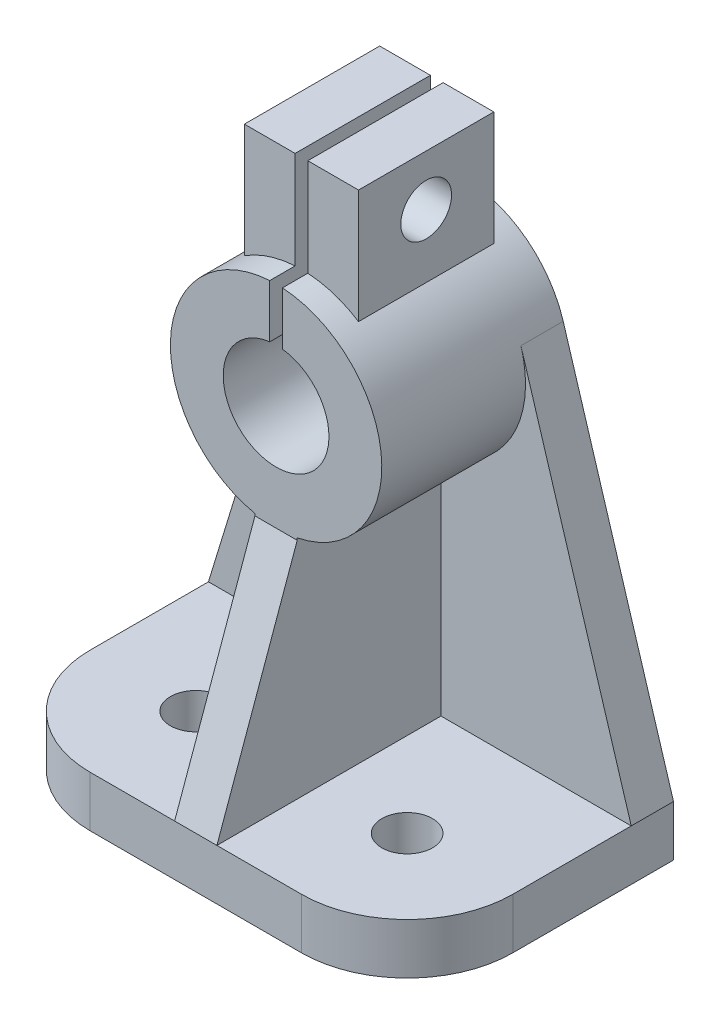
ISO-10303-21;
HEADER;
FILE_DESCRIPTION(('STEP AP214'),'2;1');
FILE_NAME('part.step','',(''),(''),'','','');
FILE_SCHEMA(('AUTOMOTIVE_DESIGN { 1 0 10303 214 1 1 1 1 }'));
ENDSEC;
DATA;
#1=APPLICATION_CONTEXT('core data for automotive mechanical design processes');
#2=APPLICATION_PROTOCOL_DEFINITION('international standard','automotive_design',2000,#1);
#3=PRODUCT_CONTEXT('',#1,'mechanical');
#4=PRODUCT('Part','Part','',(#3));
#5=PRODUCT_RELATED_PRODUCT_CATEGORY('part','',(#4));
#6=PRODUCT_DEFINITION_FORMATION('','',#4);
#7=PRODUCT_DEFINITION_CONTEXT('part definition',#1,'design');
#8=PRODUCT_DEFINITION('design','',#6,#7);
#9=PRODUCT_DEFINITION_SHAPE('','',#8);
#10=(LENGTH_UNIT() NAMED_UNIT(*) SI_UNIT(.MILLI.,.METRE.));
#11=(NAMED_UNIT(*) PLANE_ANGLE_UNIT() SI_UNIT($,.RADIAN.));
#12=(NAMED_UNIT(*) SI_UNIT($,.STERADIAN.) SOLID_ANGLE_UNIT());
#13=UNCERTAINTY_MEASURE_WITH_UNIT(LENGTH_MEASURE(1.E-05),#10,'distance_accuracy_value','');
#14=(GEOMETRIC_REPRESENTATION_CONTEXT(3) GLOBAL_UNCERTAINTY_ASSIGNED_CONTEXT((#13)) GLOBAL_UNIT_ASSIGNED_CONTEXT((#10,
#11,#12)) REPRESENTATION_CONTEXT('',''));
#15=CARTESIAN_POINT('',(0.,0.,0.));
#16=DIRECTION('',(0.,0.,1.));
#17=DIRECTION('',(1.,0.,0.));
#18=AXIS2_PLACEMENT_3D('',#15,#16,#17);
#19=CARTESIAN_POINT('',(0.,0.,-21.5));
#20=DIRECTION('',(0.,0.,-1.));
#21=DIRECTION('',(-1.,0.,0.));
#22=AXIS2_PLACEMENT_3D('',#19,#20,#21);
#23=PLANE('',#22);
#24=CARTESIAN_POINT('',(0.,90.,-21.5));
#25=DIRECTION('',(0.,0.,-1.));
#26=DIRECTION('',(-1.,0.,0.));
#27=AXIS2_PLACEMENT_3D('',#24,#25,#26);
#28=CIRCLE('',#27,25.);
#29=CARTESIAN_POINT('',(23.9067793629531,97.312038053175,-21.5));
#30=VERTEX_POINT('',#29);
#31=CARTESIAN_POINT('',(5.,65.5051025721682,-21.5));
#32=VERTEX_POINT('',#31);
#33=EDGE_CURVE('E235',#30,#32,#28,.T.);
#34=ORIENTED_EDGE('',*,*,#33,.T.);
#35=DIRECTION('',(0.,1.,0.));
#36=VECTOR('',#35,1.);
#37=CARTESIAN_POINT('',(5.,12.,-21.5));
#38=LINE('',#37,#36);
#39=CARTESIAN_POINT('',(5.,12.,-21.5));
#40=VERTEX_POINT('',#39);
#41=EDGE_CURVE('E218',#40,#32,#38,.T.);
#42=ORIENTED_EDGE('',*,*,#41,.F.);
#43=DIRECTION('',(1.,0.,0.));
#44=VECTOR('',#43,1.);
#45=CARTESIAN_POINT('',(0.,12.,-21.5));
#46=LINE('',#45,#44);
#47=CARTESIAN_POINT('',(50.,12.,-21.5));
#48=VERTEX_POINT('',#47);
#49=EDGE_CURVE('E362',#40,#48,#46,.T.);
#50=ORIENTED_EDGE('',*,*,#49,.T.);
#51=DIRECTION('',(-0.292481522127002,0.956271174518124,0.));
#52=VECTOR('',#51,1.);
#53=CARTESIAN_POINT('',(49.0790277449844,15.0111277238906,-21.5));
#54=LINE('',#53,#52);
#55=EDGE_CURVE('E244',#48,#30,#54,.T.);
#56=ORIENTED_EDGE('',*,*,#55,.T.);
#57=EDGE_LOOP('',(#34,#42,#50,#56));
#58=FACE_BOUND('',#57,.T.);
#59=ADVANCED_FACE('F44',(#58),#23,.F.);
#60=CARTESIAN_POINT('',(0.,90.,-21.5));
#61=DIRECTION('',(0.,0.,-1.));
#62=DIRECTION('',(-1.,0.,0.));
#63=AXIS2_PLACEMENT_3D('',#60,#61,#62);
#64=CYLINDRICAL_SURFACE('',#63,25.);
#65=CARTESIAN_POINT('',(0.,90.,12.5));
#66=DIRECTION('',(0.,0.,-1.));
#67=DIRECTION('',(-1.,0.,0.));
#68=AXIS2_PLACEMENT_3D('',#65,#66,#67);
#69=CIRCLE('',#68,25.);
#70=CARTESIAN_POINT('',(1.5,114.954959426936,12.5));
#71=VERTEX_POINT('',#70);
#72=CARTESIAN_POINT('',(5.,65.5051025721682,12.5));
#73=VERTEX_POINT('',#72);
#74=EDGE_CURVE('E239',#71,#73,#69,.T.);
#75=ORIENTED_EDGE('',*,*,#74,.T.);
#76=DIRECTION('',(0.,0.,-1.));
#77=VECTOR('',#76,1.);
#78=CARTESIAN_POINT('',(5.,65.5051025721682,-21.5));
#79=LINE('',#78,#77);
#80=EDGE_CURVE('E222',#32,#73,#79,.F.);
#81=ORIENTED_EDGE('',*,*,#80,.F.);
#82=ORIENTED_EDGE('',*,*,#33,.F.);
#83=DIRECTION('',(0.,0.,-1.));
#84=VECTOR('',#83,1.);
#85=CARTESIAN_POINT('',(23.9067793629531,97.312038053175,-21.5));
#86=LINE('',#85,#84);
#87=CARTESIAN_POINT('',(23.9067793629531,97.312038053175,-31.5));
#88=VERTEX_POINT('',#87);
#89=EDGE_CURVE('E339',#30,#88,#86,.T.);
#90=ORIENTED_EDGE('',*,*,#89,.T.);
#91=CARTESIAN_POINT('',(0.,90.,-31.5));
#92=DIRECTION('',(0.,0.,-1.));
#93=DIRECTION('',(-1.,0.,0.));
#94=AXIS2_PLACEMENT_3D('',#91,#92,#93);
#95=CIRCLE('',#94,25.);
#96=CARTESIAN_POINT('',(1.5,114.954959426936,-31.5));
#97=VERTEX_POINT('',#96);
#98=EDGE_CURVE('E355',#97,#88,#95,.T.);
#99=ORIENTED_EDGE('',*,*,#98,.F.);
#100=DIRECTION('',(0.,0.,-1.));
#101=VECTOR('',#100,1.);
#102=CARTESIAN_POINT('',(1.5,114.954959426936,-21.5));
#103=LINE('',#102,#101);
#104=CARTESIAN_POINT('',(1.5,114.954959426936,-25.5));
#105=VERTEX_POINT('',#104);
#106=EDGE_CURVE('E432',#105,#97,#103,.T.);
#107=ORIENTED_EDGE('',*,*,#106,.F.);
#108=CARTESIAN_POINT('',(0.,90.,-25.5));
#109=DIRECTION('',(0.,0.,-1.));
#110=DIRECTION('',(-1.,0.,0.));
#111=AXIS2_PLACEMENT_3D('',#108,#109,#110);
#112=CIRCLE('',#111,25.);
#113=CARTESIAN_POINT('',(13.5,111.041625412501,-25.5));
#114=VERTEX_POINT('',#113);
#115=EDGE_CURVE('E392',#105,#114,#112,.T.);
#116=ORIENTED_EDGE('',*,*,#115,.T.);
#117=DIRECTION('',(0.,0.,-1.));
#118=VECTOR('',#117,1.);
#119=CARTESIAN_POINT('',(13.5,111.041625412501,-21.5));
#120=LINE('',#119,#118);
#121=CARTESIAN_POINT('',(13.5,111.041625412501,6.49999999999999));
#122=VERTEX_POINT('',#121);
#123=EDGE_CURVE('E380',#114,#122,#120,.F.);
#124=ORIENTED_EDGE('',*,*,#123,.T.);
#125=CARTESIAN_POINT('',(0.,90.,6.49999999999999));
#126=DIRECTION('',(0.,0.,1.));
#127=DIRECTION('',(1.,0.,0.));
#128=AXIS2_PLACEMENT_3D('',#125,#126,#127);
#129=CIRCLE('',#128,25.);
#130=CARTESIAN_POINT('',(1.5,114.954959426936,6.49999999999999));
#131=VERTEX_POINT('',#130);
#132=EDGE_CURVE('E385',#122,#131,#129,.T.);
#133=ORIENTED_EDGE('',*,*,#132,.T.);
#134=EDGE_CURVE('E431',#71,#131,#103,.T.);
#135=ORIENTED_EDGE('',*,*,#134,.F.);
#136=EDGE_LOOP('',(#75,#81,#82,#90,#99,#107,#116,#124,#133,#135));
#137=FACE_BOUND('',#136,.T.);
#138=ADVANCED_FACE('F233',(#137),#64,.T.);
#139=CARTESIAN_POINT('',(-50.,12.,-21.5));
#140=VERTEX_POINT('',#139);
#141=CARTESIAN_POINT('',(-5.,12.,-21.5));
#142=VERTEX_POINT('',#141);
#143=EDGE_CURVE('E340',#140,#142,#46,.T.);
#144=ORIENTED_EDGE('',*,*,#143,.T.);
#145=DIRECTION('',(0.,-1.,0.));
#146=VECTOR('',#145,1.);
#147=CARTESIAN_POINT('',(-5.,138.001,-21.5));
#148=LINE('',#147,#146);
#149=CARTESIAN_POINT('',(-5.,65.5051025721682,-21.5));
#150=VERTEX_POINT('',#149);
#151=EDGE_CURVE('E61',#150,#142,#148,.T.);
#152=ORIENTED_EDGE('',*,*,#151,.F.);
#153=CARTESIAN_POINT('',(-23.9067793629531,97.3120380531751,-21.5));
#154=VERTEX_POINT('',#153);
#155=EDGE_CURVE('E247',#150,#154,#28,.T.);
#156=ORIENTED_EDGE('',*,*,#155,.T.);
#157=DIRECTION('',(0.292481522127003,0.956271174518124,0.));
#158=VECTOR('',#157,1.);
#159=CARTESIAN_POINT('',(-49.0790277449844,15.0111277238906,-21.5));
#160=LINE('',#159,#158);
#161=EDGE_CURVE('E350',#140,#154,#160,.T.);
#162=ORIENTED_EDGE('',*,*,#161,.F.);
#163=EDGE_LOOP('',(#144,#152,#156,#162));
#164=FACE_BOUND('',#163,.T.);
#165=ADVANCED_FACE('F633',(#164),#23,.F.);
#166=CARTESIAN_POINT('',(0.,12.,0.));
#167=DIRECTION('',(0.,1.,0.));
#168=DIRECTION('',(0.,0.,1.));
#169=AXIS2_PLACEMENT_3D('',#166,#167,#168);
#170=PLANE('',#169);
#171=CARTESIAN_POINT('',(-25.,12.,6.49999999999999));
#172=DIRECTION('',(0.,1.,0.));
#173=DIRECTION('',(0.,0.,1.));
#174=AXIS2_PLACEMENT_3D('',#171,#172,#173);
#175=CIRCLE('',#174,6.);
#176=CARTESIAN_POINT('',(-25.,12.,12.5));
#177=VERTEX_POINT('',#176);
#178=EDGE_CURVE('E329',#177,#177,#175,.T.);
#179=ORIENTED_EDGE('',*,*,#178,.F.);
#180=EDGE_LOOP('',(#179));
#181=FACE_BOUND('',#180,.T.);
#182=DIRECTION('',(1.,0.,0.));
#183=VECTOR('',#182,1.);
#184=CARTESIAN_POINT('',(-50.,12.,31.5));
#185=LINE('',#184,#183);
#186=CARTESIAN_POINT('',(-25.,12.,31.5));
#187=VERTEX_POINT('',#186);
#188=CARTESIAN_POINT('',(-5.,12.,31.5));
#189=VERTEX_POINT('',#188);
#190=EDGE_CURVE('E291',#187,#189,#185,.T.);
#191=ORIENTED_EDGE('',*,*,#190,.T.);
#192=DIRECTION('',(0.,0.,-1.));
#193=VECTOR('',#192,1.);
#194=CARTESIAN_POINT('',(-5.,12.,31.5));
#195=LINE('',#194,#193);
#196=EDGE_CURVE('E497',#189,#142,#195,.T.);
#197=ORIENTED_EDGE('',*,*,#196,.T.);
#198=ORIENTED_EDGE('',*,*,#143,.F.);
#199=DIRECTION('',(0.,0.,1.));
#200=VECTOR('',#199,1.);
#201=CARTESIAN_POINT('',(-50.,12.,-31.5));
#202=LINE('',#201,#200);
#203=CARTESIAN_POINT('',(-50.,12.,6.5));
#204=VERTEX_POINT('',#203);
#205=EDGE_CURVE('E316',#140,#204,#202,.T.);
#206=ORIENTED_EDGE('',*,*,#205,.T.);
#207=CARTESIAN_POINT('',(-25.,12.,6.49999999999999));
#208=DIRECTION('',(0.,1.,0.));
#209=DIRECTION('',(0.,0.,1.));
#210=AXIS2_PLACEMENT_3D('',#207,#208,#209);
#211=CIRCLE('',#210,25.);
#212=EDGE_CURVE('E262',#204,#187,#211,.T.);
#213=ORIENTED_EDGE('',*,*,#212,.T.);
#214=EDGE_LOOP('',(#191,#197,#198,#206,#213));
#215=FACE_BOUND('',#214,.T.);
#216=ADVANCED_FACE('F642',(#181,#215),#170,.T.);
#217=ORIENTED_EDGE('',*,*,#155,.F.);
#218=DIRECTION('',(0.,0.,-1.));
#219=VECTOR('',#218,1.);
#220=CARTESIAN_POINT('',(-5.,65.5051025721682,-21.5));
#221=LINE('',#220,#219);
#222=CARTESIAN_POINT('',(-5.,65.5051025721682,12.5));
#223=VERTEX_POINT('',#222);
#224=EDGE_CURVE('E481',#223,#150,#221,.T.);
#225=ORIENTED_EDGE('',*,*,#224,.F.);
#226=CARTESIAN_POINT('',(-1.50000000000001,114.954959426936,12.5));
#227=VERTEX_POINT('',#226);
#228=EDGE_CURVE('E370',#223,#227,#69,.T.);
#229=ORIENTED_EDGE('',*,*,#228,.T.);
#230=DIRECTION('',(0.,0.,-1.));
#231=VECTOR('',#230,1.);
#232=CARTESIAN_POINT('',(-1.50000000000001,114.954959426936,-21.5));
#233=LINE('',#232,#231);
#234=CARTESIAN_POINT('',(-1.50000000000001,114.954959426936,6.49999999999999));
#235=VERTEX_POINT('',#234);
#236=EDGE_CURVE('E445',#235,#227,#233,.F.);
#237=ORIENTED_EDGE('',*,*,#236,.F.);
#238=CARTESIAN_POINT('',(-13.5,111.041625412501,6.49999999999999));
#239=VERTEX_POINT('',#238);
#240=EDGE_CURVE('E383',#235,#239,#129,.T.);
#241=ORIENTED_EDGE('',*,*,#240,.T.);
#242=DIRECTION('',(0.,0.,-1.));
#243=VECTOR('',#242,1.);
#244=CARTESIAN_POINT('',(-13.5,111.041625412501,-21.5));
#245=LINE('',#244,#243);
#246=CARTESIAN_POINT('',(-13.5,111.041625412501,-25.5));
#247=VERTEX_POINT('',#246);
#248=EDGE_CURVE('E389',#239,#247,#245,.T.);
#249=ORIENTED_EDGE('',*,*,#248,.T.);
#250=CARTESIAN_POINT('',(-1.50000000000001,114.954959426936,-25.5));
#251=VERTEX_POINT('',#250);
#252=EDGE_CURVE('E376',#247,#251,#112,.T.);
#253=ORIENTED_EDGE('',*,*,#252,.T.);
#254=CARTESIAN_POINT('',(-1.50000000000001,114.954959426936,-31.5));
#255=VERTEX_POINT('',#254);
#256=EDGE_CURVE('E444',#255,#251,#233,.F.);
#257=ORIENTED_EDGE('',*,*,#256,.F.);
#258=CARTESIAN_POINT('',(-23.9067793629531,97.3120380531751,-31.5));
#259=VERTEX_POINT('',#258);
#260=EDGE_CURVE('E351',#259,#255,#95,.T.);
#261=ORIENTED_EDGE('',*,*,#260,.F.);
#262=DIRECTION('',(0.,0.,-1.));
#263=VECTOR('',#262,1.);
#264=CARTESIAN_POINT('',(-23.9067793629531,97.3120380531751,-21.5));
#265=LINE('',#264,#263);
#266=EDGE_CURVE('E336',#154,#259,#265,.T.);
#267=ORIENTED_EDGE('',*,*,#266,.F.);
#268=EDGE_LOOP('',(#217,#225,#229,#237,#241,#249,#253,#257,#261,#267));
#269=FACE_BOUND('',#268,.T.);
#270=ADVANCED_FACE('F638',(#269),#64,.T.);
#271=CARTESIAN_POINT('',(-13.5,-0.001000000000001,6.49999999999999));
#272=DIRECTION('',(0.,0.,1.));
#273=DIRECTION('',(1.,0.,0.));
#274=AXIS2_PLACEMENT_3D('',#271,#272,#273);
#275=PLANE('',#274);
#276=DIRECTION('',(0.,1.,0.));
#277=VECTOR('',#276,1.);
#278=CARTESIAN_POINT('',(1.50000000000002,-0.000999999999998225,6.49999999999999));
#279=LINE('',#278,#277);
#280=CARTESIAN_POINT('',(1.49999999999999,138.,6.49999999999999));
#281=VERTEX_POINT('',#280);
#282=EDGE_CURVE('E69',#131,#281,#279,.T.);
#283=ORIENTED_EDGE('',*,*,#282,.F.);
#284=ORIENTED_EDGE('',*,*,#132,.F.);
#285=DIRECTION('',(0.,1.,0.));
#286=VECTOR('',#285,1.);
#287=CARTESIAN_POINT('',(13.5,-0.001000000000001,6.49999999999999));
#288=LINE('',#287,#286);
#289=CARTESIAN_POINT('',(13.5,138.,6.49999999999999));
#290=VERTEX_POINT('',#289);
#291=EDGE_CURVE('E407',#122,#290,#288,.T.);
#292=ORIENTED_EDGE('',*,*,#291,.T.);
#293=DIRECTION('',(1.,0.,0.));
#294=VECTOR('',#293,1.);
#295=CARTESIAN_POINT('',(-13.5,138.,6.49999999999999));
#296=LINE('',#295,#294);
#297=EDGE_CURVE('E424',#281,#290,#296,.T.);
#298=ORIENTED_EDGE('',*,*,#297,.F.);
#299=EDGE_LOOP('',(#283,#284,#292,#298));
#300=FACE_BOUND('',#299,.T.);
#301=ADVANCED_FACE('F695',(#300),#275,.T.);
#302=CARTESIAN_POINT('',(-13.5,-0.001000000000001,-25.5));
#303=DIRECTION('',(0.,0.,-1.));
#304=DIRECTION('',(-1.,0.,0.));
#305=AXIS2_PLACEMENT_3D('',#302,#303,#304);
#306=PLANE('',#305);
#307=DIRECTION('',(0.,-1.,0.));
#308=VECTOR('',#307,1.);
#309=CARTESIAN_POINT('',(1.50000000000002,-0.000999999999998225,-25.5));
#310=LINE('',#309,#308);
#311=CARTESIAN_POINT('',(1.49999999999999,138.,-25.5));
#312=VERTEX_POINT('',#311);
#313=EDGE_CURVE('E437',#312,#105,#310,.T.);
#314=ORIENTED_EDGE('',*,*,#313,.F.);
#315=DIRECTION('',(-1.,0.,0.));
#316=VECTOR('',#315,1.);
#317=CARTESIAN_POINT('',(-13.5,138.,-25.5));
#318=LINE('',#317,#316);
#319=CARTESIAN_POINT('',(13.5,138.,-25.5));
#320=VERTEX_POINT('',#319);
#321=EDGE_CURVE('E416',#320,#312,#318,.T.);
#322=ORIENTED_EDGE('',*,*,#321,.F.);
#323=DIRECTION('',(0.,1.,0.));
#324=VECTOR('',#323,1.);
#325=CARTESIAN_POINT('',(13.5,-0.001000000000001,-25.5));
#326=LINE('',#325,#324);
#327=EDGE_CURVE('E396',#114,#320,#326,.T.);
#328=ORIENTED_EDGE('',*,*,#327,.F.);
#329=ORIENTED_EDGE('',*,*,#115,.F.);
#330=EDGE_LOOP('',(#314,#322,#328,#329));
#331=FACE_BOUND('',#330,.T.);
#332=ADVANCED_FACE('F706',(#331),#306,.T.);
#333=CARTESIAN_POINT('',(0.,138.,0.));
#334=DIRECTION('',(0.,-1.,0.));
#335=DIRECTION('',(0.,0.,-1.));
#336=AXIS2_PLACEMENT_3D('',#333,#334,#335);
#337=PLANE('',#336);
#338=ORIENTED_EDGE('',*,*,#321,.T.);
#339=DIRECTION('',(0.,0.,1.));
#340=VECTOR('',#339,1.);
#341=CARTESIAN_POINT('',(1.49999999999999,138.,0.));
#342=LINE('',#341,#340);
#343=EDGE_CURVE('E11',#312,#281,#342,.T.);
#344=ORIENTED_EDGE('',*,*,#343,.T.);
#345=ORIENTED_EDGE('',*,*,#297,.T.);
#346=DIRECTION('',(0.,0.,-1.));
#347=VECTOR('',#346,1.);
#348=CARTESIAN_POINT('',(13.5,138.,6.49999999999999));
#349=LINE('',#348,#347);
#350=EDGE_CURVE('E399',#290,#320,#349,.T.);
#351=ORIENTED_EDGE('',*,*,#350,.T.);
#352=EDGE_LOOP('',(#338,#344,#345,#351));
#353=FACE_BOUND('',#352,.T.);
#354=ADVANCED_FACE('F703',(#353),#337,.F.);
#355=CARTESIAN_POINT('',(50.,12.,-31.5));
#356=DIRECTION('',(-1.,0.,0.));
#357=DIRECTION('',(0.,0.,1.));
#358=AXIS2_PLACEMENT_3D('',#355,#356,#357);
#359=PLANE('',#358);
#360=DIRECTION('',(0.,0.,-1.));
#361=VECTOR('',#360,1.);
#362=CARTESIAN_POINT('',(50.,12.,-31.5));
#363=LINE('',#362,#361);
#364=CARTESIAN_POINT('',(50.,12.,6.49999999999999));
#365=VERTEX_POINT('',#364);
#366=EDGE_CURVE('E296',#365,#48,#363,.T.);
#367=ORIENTED_EDGE('',*,*,#366,.F.);
#368=DIRECTION('',(0.,-1.,0.));
#369=VECTOR('',#368,1.);
#370=CARTESIAN_POINT('',(50.,12.,6.49999999999999));
#371=LINE('',#370,#369);
#372=CARTESIAN_POINT('',(50.,0.,6.49999999999999));
#373=VERTEX_POINT('',#372);
#374=EDGE_CURVE('E279',#365,#373,#371,.T.);
#375=ORIENTED_EDGE('',*,*,#374,.T.);
#376=DIRECTION('',(0.,0.,-1.));
#377=VECTOR('',#376,1.);
#378=CARTESIAN_POINT('',(50.,0.,-31.5));
#379=LINE('',#378,#377);
#380=CARTESIAN_POINT('',(50.,0.,-31.5));
#381=VERTEX_POINT('',#380);
#382=EDGE_CURVE('E304',#373,#381,#379,.T.);
#383=ORIENTED_EDGE('',*,*,#382,.T.);
#384=DIRECTION('',(0.,-1.,0.));
#385=VECTOR('',#384,1.);
#386=CARTESIAN_POINT('',(50.,12.,-31.5));
#387=LINE('',#386,#385);
#388=CARTESIAN_POINT('',(50.,12.,-31.5));
#389=VERTEX_POINT('',#388);
#390=EDGE_CURVE('E283',#389,#381,#387,.T.);
#391=ORIENTED_EDGE('',*,*,#390,.F.);
#392=DIRECTION('',(0.,0.,-1.));
#393=VECTOR('',#392,1.);
#394=CARTESIAN_POINT('',(50.,12.,-21.5));
#395=LINE('',#394,#393);
#396=EDGE_CURVE('E325',#48,#389,#395,.T.);
#397=ORIENTED_EDGE('',*,*,#396,.F.);
#398=EDGE_LOOP('',(#367,#375,#383,#391,#397));
#399=FACE_BOUND('',#398,.T.);
#400=ADVANCED_FACE('F677',(#399),#359,.F.);
#401=CARTESIAN_POINT('',(-50.,12.,-31.5));
#402=DIRECTION('',(0.,0.,1.));
#403=DIRECTION('',(1.,0.,0.));
#404=AXIS2_PLACEMENT_3D('',#401,#402,#403);
#405=PLANE('',#404);
#406=CARTESIAN_POINT('',(0.,90.,-31.5));
#407=DIRECTION('',(0.,0.,1.));
#408=DIRECTION('',(1.,0.,0.));
#409=AXIS2_PLACEMENT_3D('',#406,#407,#408);
#410=CIRCLE('',#409,12.5);
#411=CARTESIAN_POINT('',(-1.5,102.409673645991,-31.5));
#412=VERTEX_POINT('',#411);
#413=CARTESIAN_POINT('',(1.5,102.409673645991,-31.5));
#414=VERTEX_POINT('',#413);
#415=EDGE_CURVE('E375',#412,#414,#410,.T.);
#416=ORIENTED_EDGE('',*,*,#415,.T.);
#417=DIRECTION('',(0.,1.,0.));
#418=VECTOR('',#417,1.);
#419=CARTESIAN_POINT('',(1.5,82.0309920005747,-31.5));
#420=LINE('',#419,#418);
#421=EDGE_CURVE('E459',#414,#97,#420,.T.);
#422=ORIENTED_EDGE('',*,*,#421,.T.);
#423=ORIENTED_EDGE('',*,*,#98,.T.);
#424=DIRECTION('',(-0.292481522127002,0.956271174518124,0.));
#425=VECTOR('',#424,1.);
#426=CARTESIAN_POINT('',(49.0790277449844,15.0111277238906,-31.5));
#427=LINE('',#426,#425);
#428=EDGE_CURVE('E346',#389,#88,#427,.T.);
#429=ORIENTED_EDGE('',*,*,#428,.F.);
#430=ORIENTED_EDGE('',*,*,#390,.T.);
#431=DIRECTION('',(-1.,0.,0.));
#432=VECTOR('',#431,1.);
#433=CARTESIAN_POINT('',(-50.,0.,-31.5));
#434=LINE('',#433,#432);
#435=CARTESIAN_POINT('',(-50.,0.,-31.5));
#436=VERTEX_POINT('',#435);
#437=EDGE_CURVE('E301',#381,#436,#434,.T.);
#438=ORIENTED_EDGE('',*,*,#437,.T.);
#439=DIRECTION('',(0.,-1.,0.));
#440=VECTOR('',#439,1.);
#441=CARTESIAN_POINT('',(-50.,12.,-31.5));
#442=LINE('',#441,#440);
#443=CARTESIAN_POINT('',(-50.,12.,-31.5));
#444=VERTEX_POINT('',#443);
#445=EDGE_CURVE('E287',#444,#436,#442,.T.);
#446=ORIENTED_EDGE('',*,*,#445,.F.);
#447=DIRECTION('',(0.292481522127003,0.956271174518124,0.));
#448=VECTOR('',#447,1.);
#449=CARTESIAN_POINT('',(-49.0790277449844,15.0111277238906,-31.5));
#450=LINE('',#449,#448);
#451=EDGE_CURVE('E356',#444,#259,#450,.T.);
#452=ORIENTED_EDGE('',*,*,#451,.T.);
#453=ORIENTED_EDGE('',*,*,#260,.T.);
#454=DIRECTION('',(0.,-1.,0.));
#455=VECTOR('',#454,1.);
#456=CARTESIAN_POINT('',(-1.5,82.0309920005747,-31.5));
#457=LINE('',#456,#455);
#458=EDGE_CURVE('E455',#255,#412,#457,.T.);
#459=ORIENTED_EDGE('',*,*,#458,.T.);
#460=EDGE_LOOP('',(#416,#422,#423,#429,#430,#438,#446,#452,#453,#459));
#461=FACE_BOUND('',#460,.T.);
#462=ADVANCED_FACE('F662',(#461),#405,.F.);
#463=CARTESIAN_POINT('',(-50.,12.,-31.5));
#464=DIRECTION('',(1.,0.,0.));
#465=DIRECTION('',(0.,0.,-1.));
#466=AXIS2_PLACEMENT_3D('',#463,#464,#465);
#467=PLANE('',#466);
#468=DIRECTION('',(0.,0.,1.));
#469=VECTOR('',#468,1.);
#470=CARTESIAN_POINT('',(-50.,0.,-31.5));
#471=LINE('',#470,#469);
#472=CARTESIAN_POINT('',(-50.,0.,6.5));
#473=VERTEX_POINT('',#472);
#474=EDGE_CURVE('E297',#436,#473,#471,.T.);
#475=ORIENTED_EDGE('',*,*,#474,.T.);
#476=DIRECTION('',(0.,-1.,0.));
#477=VECTOR('',#476,1.);
#478=CARTESIAN_POINT('',(-50.,12.,6.5));
#479=LINE('',#478,#477);
#480=EDGE_CURVE('E254',#473,#204,#479,.F.);
#481=ORIENTED_EDGE('',*,*,#480,.T.);
#482=ORIENTED_EDGE('',*,*,#205,.F.);
#483=EDGE_CURVE('E312',#444,#140,#202,.T.);
#484=ORIENTED_EDGE('',*,*,#483,.F.);
#485=ORIENTED_EDGE('',*,*,#445,.T.);
#486=EDGE_LOOP('',(#475,#481,#482,#484,#485));
#487=FACE_BOUND('',#486,.T.);
#488=ADVANCED_FACE('F653',(#487),#467,.F.);
#489=CARTESIAN_POINT('',(-50.,12.,31.5));
#490=DIRECTION('',(0.,0.,-1.));
#491=DIRECTION('',(-1.,0.,0.));
#492=AXIS2_PLACEMENT_3D('',#489,#490,#491);
#493=PLANE('',#492);
#494=DIRECTION('',(1.,0.,0.));
#495=VECTOR('',#494,1.);
#496=CARTESIAN_POINT('',(-50.,0.,31.5));
#497=LINE('',#496,#495);
#498=CARTESIAN_POINT('',(-25.,0.,31.5));
#499=VERTEX_POINT('',#498);
#500=CARTESIAN_POINT('',(25.,0.,31.5));
#501=VERTEX_POINT('',#500);
#502=EDGE_CURVE('E292',#499,#501,#497,.T.);
#503=ORIENTED_EDGE('',*,*,#502,.T.);
#504=DIRECTION('',(0.,-1.,0.));
#505=VECTOR('',#504,1.);
#506=CARTESIAN_POINT('',(25.,12.,31.5));
#507=LINE('',#506,#505);
#508=CARTESIAN_POINT('',(25.,12.,31.5));
#509=VERTEX_POINT('',#508);
#510=EDGE_CURVE('E265',#501,#509,#507,.F.);
#511=ORIENTED_EDGE('',*,*,#510,.T.);
#512=CARTESIAN_POINT('',(5.,12.,31.5));
#513=VERTEX_POINT('',#512);
#514=EDGE_CURVE('E311',#513,#509,#185,.T.);
#515=ORIENTED_EDGE('',*,*,#514,.F.);
#516=DIRECTION('',(-1.,0.,0.));
#517=VECTOR('',#516,1.);
#518=CARTESIAN_POINT('',(5.,12.,31.5));
#519=LINE('',#518,#517);
#520=EDGE_CURVE('E230',#513,#189,#519,.T.);
#521=ORIENTED_EDGE('',*,*,#520,.T.);
#522=ORIENTED_EDGE('',*,*,#190,.F.);
#523=DIRECTION('',(0.,-1.,0.));
#524=VECTOR('',#523,1.);
#525=CARTESIAN_POINT('',(-25.,12.,31.5));
#526=LINE('',#525,#524);
#527=EDGE_CURVE('E269',#187,#499,#526,.T.);
#528=ORIENTED_EDGE('',*,*,#527,.T.);
#529=EDGE_LOOP('',(#503,#511,#515,#521,#522,#528));
#530=FACE_BOUND('',#529,.T.);
#531=ADVANCED_FACE('F524',(#530),#493,.F.);
#532=DIRECTION('',(0.,0.,-1.));
#533=VECTOR('',#532,1.);
#534=CARTESIAN_POINT('',(5.,12.,31.5));
#535=LINE('',#534,#533);
#536=EDGE_CURVE('E225',#513,#40,#535,.T.);
#537=ORIENTED_EDGE('',*,*,#536,.F.);
#538=ORIENTED_EDGE('',*,*,#514,.T.);
#539=CARTESIAN_POINT('',(25.,12.,6.49999999999999));
#540=DIRECTION('',(0.,1.,0.));
#541=DIRECTION('',(0.,0.,1.));
#542=AXIS2_PLACEMENT_3D('',#539,#540,#541);
#543=CIRCLE('',#542,25.);
#544=EDGE_CURVE('E259',#509,#365,#543,.T.);
#545=ORIENTED_EDGE('',*,*,#544,.T.);
#546=ORIENTED_EDGE('',*,*,#366,.T.);
#547=ORIENTED_EDGE('',*,*,#49,.F.);
#548=EDGE_LOOP('',(#537,#538,#545,#546,#547));
#549=FACE_BOUND('',#548,.T.);
#550=CARTESIAN_POINT('',(25.,12.,6.49999999999999));
#551=DIRECTION('',(0.,1.,0.));
#552=DIRECTION('',(0.,0.,1.));
#553=AXIS2_PLACEMENT_3D('',#550,#551,#552);
#554=CIRCLE('',#553,6.);
#555=CARTESIAN_POINT('',(25.,12.,12.5));
#556=VERTEX_POINT('',#555);
#557=EDGE_CURVE('E320',#556,#556,#554,.T.);
#558=ORIENTED_EDGE('',*,*,#557,.F.);
#559=EDGE_LOOP('',(#558));
#560=FACE_BOUND('',#559,.T.);
#561=ADVANCED_FACE('F522',(#549,#560),#170,.T.);
#562=CARTESIAN_POINT('',(0.,0.,0.));
#563=DIRECTION('',(0.,1.,0.));
#564=DIRECTION('',(0.,0.,1.));
#565=AXIS2_PLACEMENT_3D('',#562,#563,#564);
#566=PLANE('',#565);
#567=CARTESIAN_POINT('',(-25.,0.,6.49999999999999));
#568=DIRECTION('',(0.,1.,0.));
#569=DIRECTION('',(0.,0.,1.));
#570=AXIS2_PLACEMENT_3D('',#567,#568,#569);
#571=CIRCLE('',#570,6.);
#572=CARTESIAN_POINT('',(-25.,0.,12.5));
#573=VERTEX_POINT('',#572);
#574=EDGE_CURVE('E307',#573,#573,#571,.T.);
#575=ORIENTED_EDGE('',*,*,#574,.T.);
#576=EDGE_LOOP('',(#575));
#577=FACE_BOUND('',#576,.T.);
#578=CARTESIAN_POINT('',(25.,0.,6.49999999999999));
#579=DIRECTION('',(0.,1.,0.));
#580=DIRECTION('',(0.,0.,1.));
#581=AXIS2_PLACEMENT_3D('',#578,#579,#580);
#582=CIRCLE('',#581,6.);
#583=CARTESIAN_POINT('',(25.,0.,12.5));
#584=VERTEX_POINT('',#583);
#585=EDGE_CURVE('E324',#584,#584,#582,.T.);
#586=ORIENTED_EDGE('',*,*,#585,.T.);
#587=EDGE_LOOP('',(#586));
#588=FACE_BOUND('',#587,.T.);
#589=ORIENTED_EDGE('',*,*,#382,.F.);
#590=CARTESIAN_POINT('',(25.,0.,6.49999999999999));
#591=DIRECTION('',(0.,1.,0.));
#592=DIRECTION('',(0.,0.,1.));
#593=AXIS2_PLACEMENT_3D('',#590,#591,#592);
#594=CIRCLE('',#593,25.);
#595=EDGE_CURVE('E273',#373,#501,#594,.F.);
#596=ORIENTED_EDGE('',*,*,#595,.T.);
#597=ORIENTED_EDGE('',*,*,#502,.F.);
#598=CARTESIAN_POINT('',(-25.,0.,6.49999999999999));
#599=DIRECTION('',(0.,1.,0.));
#600=DIRECTION('',(0.,0.,1.));
#601=AXIS2_PLACEMENT_3D('',#598,#599,#600);
#602=CIRCLE('',#601,25.);
#603=EDGE_CURVE('E276',#499,#473,#602,.F.);
#604=ORIENTED_EDGE('',*,*,#603,.T.);
#605=ORIENTED_EDGE('',*,*,#474,.F.);
#606=ORIENTED_EDGE('',*,*,#437,.F.);
#607=EDGE_LOOP('',(#589,#596,#597,#604,#605,#606));
#608=FACE_BOUND('',#607,.T.);
#609=ADVANCED_FACE('F667',(#577,#588,#608),#566,.F.);
#610=CARTESIAN_POINT('',(25.,12.,6.49999999999999));
#611=DIRECTION('',(0.,-1.,0.));
#612=DIRECTION('',(0.,0.,-1.));
#613=AXIS2_PLACEMENT_3D('',#610,#611,#612);
#614=CYLINDRICAL_SURFACE('',#613,25.);
#615=ORIENTED_EDGE('',*,*,#544,.F.);
#616=ORIENTED_EDGE('',*,*,#510,.F.);
#617=ORIENTED_EDGE('',*,*,#595,.F.);
#618=ORIENTED_EDGE('',*,*,#374,.F.);
#619=EDGE_LOOP('',(#615,#616,#617,#618));
#620=FACE_BOUND('',#619,.T.);
#621=ADVANCED_FACE('F672',(#620),#614,.T.);
#622=CARTESIAN_POINT('',(-25.,12.,6.49999999999999));
#623=DIRECTION('',(0.,-1.,0.));
#624=DIRECTION('',(0.,0.,-1.));
#625=AXIS2_PLACEMENT_3D('',#622,#623,#624);
#626=CYLINDRICAL_SURFACE('',#625,25.);
#627=ORIENTED_EDGE('',*,*,#212,.F.);
#628=ORIENTED_EDGE('',*,*,#480,.F.);
#629=ORIENTED_EDGE('',*,*,#603,.F.);
#630=ORIENTED_EDGE('',*,*,#527,.F.);
#631=EDGE_LOOP('',(#627,#628,#629,#630));
#632=FACE_BOUND('',#631,.T.);
#633=ADVANCED_FACE('F46',(#632),#626,.T.);
#634=CARTESIAN_POINT('',(25.,0.,6.49999999999999));
#635=DIRECTION('',(0.,1.,0.));
#636=DIRECTION('',(0.,0.,1.));
#637=AXIS2_PLACEMENT_3D('',#634,#635,#636);
#638=CYLINDRICAL_SURFACE('',#637,6.);
#639=ORIENTED_EDGE('',*,*,#585,.F.);
#640=EDGE_LOOP('',(#639));
#641=FACE_BOUND('',#640,.T.);
#642=ORIENTED_EDGE('',*,*,#557,.T.);
#643=EDGE_LOOP('',(#642));
#644=FACE_BOUND('',#643,.T.);
#645=ADVANCED_FACE('F865',(#641,#644),#638,.F.);
#646=CARTESIAN_POINT('',(-25.,0.,6.49999999999999));
#647=DIRECTION('',(0.,1.,0.));
#648=DIRECTION('',(0.,0.,1.));
#649=AXIS2_PLACEMENT_3D('',#646,#647,#648);
#650=CYLINDRICAL_SURFACE('',#649,6.);
#651=ORIENTED_EDGE('',*,*,#574,.F.);
#652=EDGE_LOOP('',(#651));
#653=FACE_BOUND('',#652,.T.);
#654=ORIENTED_EDGE('',*,*,#178,.T.);
#655=EDGE_LOOP('',(#654));
#656=FACE_BOUND('',#655,.T.);
#657=ADVANCED_FACE('F855',(#653,#656),#650,.F.);
#658=CARTESIAN_POINT('',(-49.0790277449844,15.0111277238906,-21.5));
#659=DIRECTION('',(-0.956271174518124,0.292481522127003,0.));
#660=DIRECTION('',(-0.292481522127003,-0.956271174518124,0.));
#661=AXIS2_PLACEMENT_3D('',#658,#659,#660);
#662=PLANE('',#661);
#663=ORIENTED_EDGE('',*,*,#451,.F.);
#664=ORIENTED_EDGE('',*,*,#483,.T.);
#665=ORIENTED_EDGE('',*,*,#161,.T.);
#666=ORIENTED_EDGE('',*,*,#266,.T.);
#667=EDGE_LOOP('',(#663,#664,#665,#666));
#668=FACE_BOUND('',#667,.T.);
#669=ADVANCED_FACE('F658',(#668),#662,.T.);
#670=CARTESIAN_POINT('',(49.0790277449844,15.0111277238906,-21.5));
#671=DIRECTION('',(-0.956271174518124,-0.292481522127002,0.));
#672=DIRECTION('',(0.292481522127002,-0.956271174518124,0.));
#673=AXIS2_PLACEMENT_3D('',#670,#671,#672);
#674=PLANE('',#673);
#675=ORIENTED_EDGE('',*,*,#428,.T.);
#676=ORIENTED_EDGE('',*,*,#89,.F.);
#677=ORIENTED_EDGE('',*,*,#55,.F.);
#678=ORIENTED_EDGE('',*,*,#396,.T.);
#679=EDGE_LOOP('',(#675,#676,#677,#678));
#680=FACE_BOUND('',#679,.T.);
#681=ADVANCED_FACE('F680',(#680),#674,.F.);
#682=CARTESIAN_POINT('',(0.,0.,12.5));
#683=DIRECTION('',(0.,0.,-1.));
#684=DIRECTION('',(-1.,0.,0.));
#685=AXIS2_PLACEMENT_3D('',#682,#683,#684);
#686=PLANE('',#685);
#687=ORIENTED_EDGE('',*,*,#74,.F.);
#688=DIRECTION('',(0.,1.,0.));
#689=VECTOR('',#688,1.);
#690=CARTESIAN_POINT('',(1.5,82.0309920005747,12.5));
#691=LINE('',#690,#689);
#692=CARTESIAN_POINT('',(1.5,102.409673645991,12.5));
#693=VERTEX_POINT('',#692);
#694=EDGE_CURVE('E460',#693,#71,#691,.T.);
#695=ORIENTED_EDGE('',*,*,#694,.F.);
#696=CARTESIAN_POINT('',(0.,90.,12.5));
#697=DIRECTION('',(0.,0.,1.));
#698=DIRECTION('',(1.,0.,0.));
#699=AXIS2_PLACEMENT_3D('',#696,#697,#698);
#700=CIRCLE('',#699,12.5);
#701=CARTESIAN_POINT('',(-1.5,102.409673645991,12.5));
#702=VERTEX_POINT('',#701);
#703=EDGE_CURVE('E371',#702,#693,#700,.T.);
#704=ORIENTED_EDGE('',*,*,#703,.F.);
#705=DIRECTION('',(0.,-1.,0.));
#706=VECTOR('',#705,1.);
#707=CARTESIAN_POINT('',(-1.5,82.0309920005747,12.5));
#708=LINE('',#707,#706);
#709=EDGE_CURVE('E456',#227,#702,#708,.T.);
#710=ORIENTED_EDGE('',*,*,#709,.F.);
#711=ORIENTED_EDGE('',*,*,#228,.F.);
#712=DIRECTION('',(0.,-1.,0.));
#713=VECTOR('',#712,1.);
#714=CARTESIAN_POINT('',(-5.,138.001,12.5));
#715=LINE('',#714,#713);
#716=CARTESIAN_POINT('',(-5.,65.,12.5));
#717=VERTEX_POINT('',#716);
#718=EDGE_CURVE('E484',#223,#717,#715,.T.);
#719=ORIENTED_EDGE('',*,*,#718,.T.);
#720=DIRECTION('',(1.,0.,0.));
#721=VECTOR('',#720,1.);
#722=CARTESIAN_POINT('',(-5.,65.,12.5));
#723=LINE('',#722,#721);
#724=CARTESIAN_POINT('',(5.,65.,12.5));
#725=VERTEX_POINT('',#724);
#726=EDGE_CURVE('E488',#717,#725,#723,.T.);
#727=ORIENTED_EDGE('',*,*,#726,.T.);
#728=DIRECTION('',(0.,-1.,0.));
#729=VECTOR('',#728,1.);
#730=CARTESIAN_POINT('',(5.,138.001,12.5));
#731=LINE('',#730,#729);
#732=EDGE_CURVE('E241',#73,#725,#731,.T.);
#733=ORIENTED_EDGE('',*,*,#732,.F.);
#734=EDGE_LOOP('',(#687,#695,#704,#710,#711,#719,#727,#733));
#735=FACE_BOUND('',#734,.T.);
#736=ADVANCED_FACE('F690',(#735),#686,.F.);
#737=CARTESIAN_POINT('',(0.,90.,-31.5));
#738=DIRECTION('',(0.,0.,1.));
#739=DIRECTION('',(1.,0.,0.));
#740=AXIS2_PLACEMENT_3D('',#737,#738,#739);
#741=CYLINDRICAL_SURFACE('',#740,12.5);
#742=ORIENTED_EDGE('',*,*,#703,.T.);
#743=DIRECTION('',(0.,0.,1.));
#744=VECTOR('',#743,1.);
#745=CARTESIAN_POINT('',(1.5,102.409673645991,-31.5));
#746=LINE('',#745,#744);
#747=EDGE_CURVE('E411',#693,#414,#746,.F.);
#748=ORIENTED_EDGE('',*,*,#747,.T.);
#749=ORIENTED_EDGE('',*,*,#415,.F.);
#750=DIRECTION('',(0.,0.,1.));
#751=VECTOR('',#750,1.);
#752=CARTESIAN_POINT('',(-1.5,102.409673645991,-31.5));
#753=LINE('',#752,#751);
#754=EDGE_CURVE('E440',#412,#702,#753,.T.);
#755=ORIENTED_EDGE('',*,*,#754,.T.);
#756=EDGE_LOOP('',(#742,#748,#749,#755));
#757=FACE_BOUND('',#756,.T.);
#758=ADVANCED_FACE('F687',(#757),#741,.F.);
#759=DIRECTION('',(0.,-1.,0.));
#760=VECTOR('',#759,1.);
#761=CARTESIAN_POINT('',(-1.49999999999998,-0.00099999999999878,6.49999999999999));
#762=LINE('',#761,#760);
#763=CARTESIAN_POINT('',(-1.50000000000001,138.,6.49999999999999));
#764=VERTEX_POINT('',#763);
#765=EDGE_CURVE('E449',#764,#235,#762,.T.);
#766=ORIENTED_EDGE('',*,*,#765,.F.);
#767=CARTESIAN_POINT('',(-13.5,138.,6.49999999999999));
#768=VERTEX_POINT('',#767);
#769=EDGE_CURVE('E384',#768,#764,#296,.T.);
#770=ORIENTED_EDGE('',*,*,#769,.F.);
#771=DIRECTION('',(0.,1.,0.));
#772=VECTOR('',#771,1.);
#773=CARTESIAN_POINT('',(-13.5,-0.001000000000001,6.49999999999999));
#774=LINE('',#773,#772);
#775=EDGE_CURVE('E404',#239,#768,#774,.T.);
#776=ORIENTED_EDGE('',*,*,#775,.F.);
#777=ORIENTED_EDGE('',*,*,#240,.F.);
#778=EDGE_LOOP('',(#766,#770,#776,#777));
#779=FACE_BOUND('',#778,.T.);
#780=ADVANCED_FACE('F717',(#779),#275,.T.);
#781=CARTESIAN_POINT('',(-13.5,-0.001000000000001,6.49999999999999));
#782=DIRECTION('',(-1.,0.,0.));
#783=DIRECTION('',(0.,0.,1.));
#784=AXIS2_PLACEMENT_3D('',#781,#782,#783);
#785=PLANE('',#784);
#786=CARTESIAN_POINT('',(-13.5,126.,-9.50000000000001));
#787=DIRECTION('',(-1.,0.,0.));
#788=DIRECTION('',(0.,0.,1.));
#789=AXIS2_PLACEMENT_3D('',#786,#787,#788);
#790=CIRCLE('',#789,6.);
#791=CARTESIAN_POINT('',(-13.5,126.,-3.50000000000001));
#792=VERTEX_POINT('',#791);
#793=EDGE_CURVE('E463',#792,#792,#790,.T.);
#794=ORIENTED_EDGE('',*,*,#793,.F.);
#795=EDGE_LOOP('',(#794));
#796=FACE_BOUND('',#795,.T.);
#797=ORIENTED_EDGE('',*,*,#248,.F.);
#798=ORIENTED_EDGE('',*,*,#775,.T.);
#799=DIRECTION('',(0.,0.,1.));
#800=VECTOR('',#799,1.);
#801=CARTESIAN_POINT('',(-13.5,138.,6.49999999999999));
#802=LINE('',#801,#800);
#803=CARTESIAN_POINT('',(-13.5,138.,-25.5));
#804=VERTEX_POINT('',#803);
#805=EDGE_CURVE('E420',#804,#768,#802,.T.);
#806=ORIENTED_EDGE('',*,*,#805,.F.);
#807=DIRECTION('',(0.,1.,0.));
#808=VECTOR('',#807,1.);
#809=CARTESIAN_POINT('',(-13.5,-0.001000000000001,-25.5));
#810=LINE('',#809,#808);
#811=EDGE_CURVE('E400',#247,#804,#810,.T.);
#812=ORIENTED_EDGE('',*,*,#811,.F.);
#813=EDGE_LOOP('',(#797,#798,#806,#812));
#814=FACE_BOUND('',#813,.T.);
#815=ADVANCED_FACE('F721',(#796,#814),#785,.T.);
#816=DIRECTION('',(0.,1.,0.));
#817=VECTOR('',#816,1.);
#818=CARTESIAN_POINT('',(-1.49999999999998,-0.00099999999999878,-25.5));
#819=LINE('',#818,#817);
#820=CARTESIAN_POINT('',(-1.50000000000001,138.,-25.5));
#821=VERTEX_POINT('',#820);
#822=EDGE_CURVE('E452',#251,#821,#819,.T.);
#823=ORIENTED_EDGE('',*,*,#822,.F.);
#824=ORIENTED_EDGE('',*,*,#252,.F.);
#825=ORIENTED_EDGE('',*,*,#811,.T.);
#826=EDGE_CURVE('E415',#821,#804,#318,.T.);
#827=ORIENTED_EDGE('',*,*,#826,.F.);
#828=EDGE_LOOP('',(#823,#824,#825,#827));
#829=FACE_BOUND('',#828,.T.);
#830=ADVANCED_FACE('F709',(#829),#306,.T.);
#831=CARTESIAN_POINT('',(13.5,-0.001000000000001,6.49999999999999));
#832=DIRECTION('',(1.,0.,0.));
#833=DIRECTION('',(0.,0.,-1.));
#834=AXIS2_PLACEMENT_3D('',#831,#832,#833);
#835=PLANE('',#834);
#836=CARTESIAN_POINT('',(13.5,126.,-9.50000000000001));
#837=DIRECTION('',(1.,0.,0.));
#838=DIRECTION('',(0.,0.,-1.));
#839=AXIS2_PLACEMENT_3D('',#836,#837,#838);
#840=CIRCLE('',#839,6.);
#841=CARTESIAN_POINT('',(13.5,126.,-15.5));
#842=VERTEX_POINT('',#841);
#843=EDGE_CURVE('E477',#842,#842,#840,.T.);
#844=ORIENTED_EDGE('',*,*,#843,.F.);
#845=EDGE_LOOP('',(#844));
#846=FACE_BOUND('',#845,.T.);
#847=ORIENTED_EDGE('',*,*,#123,.F.);
#848=ORIENTED_EDGE('',*,*,#327,.T.);
#849=ORIENTED_EDGE('',*,*,#350,.F.);
#850=ORIENTED_EDGE('',*,*,#291,.F.);
#851=EDGE_LOOP('',(#847,#848,#849,#850));
#852=FACE_BOUND('',#851,.T.);
#853=ADVANCED_FACE('F699',(#846,#852),#835,.T.);
#854=ORIENTED_EDGE('',*,*,#769,.T.);
#855=DIRECTION('',(0.,0.,-1.));
#856=VECTOR('',#855,1.);
#857=CARTESIAN_POINT('',(-1.50000000000001,138.,0.));
#858=LINE('',#857,#856);
#859=EDGE_CURVE('E54',#764,#821,#858,.T.);
#860=ORIENTED_EDGE('',*,*,#859,.T.);
#861=ORIENTED_EDGE('',*,*,#826,.T.);
#862=ORIENTED_EDGE('',*,*,#805,.T.);
#863=EDGE_LOOP('',(#854,#860,#861,#862));
#864=FACE_BOUND('',#863,.T.);
#865=ADVANCED_FACE('F715',(#864),#337,.F.);
#866=CARTESIAN_POINT('',(-1.5,82.0309920005747,-31.5));
#867=DIRECTION('',(-1.,0.,0.));
#868=DIRECTION('',(0.,-1.,0.));
#869=AXIS2_PLACEMENT_3D('',#866,#867,#868);
#870=PLANE('',#869);
#871=CARTESIAN_POINT('',(-1.50000000000001,126.,-9.50000000000001));
#872=DIRECTION('',(-1.,0.,0.));
#873=DIRECTION('',(0.,-1.,0.));
#874=AXIS2_PLACEMENT_3D('',#871,#872,#873);
#875=CIRCLE('',#874,6.);
#876=CARTESIAN_POINT('',(-1.50000000000001,120.,-9.50000000000001));
#877=VERTEX_POINT('',#876);
#878=EDGE_CURVE('E473',#877,#877,#875,.T.);
#879=ORIENTED_EDGE('',*,*,#878,.T.);
#880=EDGE_LOOP('',(#879));
#881=FACE_BOUND('',#880,.T.);
#882=ORIENTED_EDGE('',*,*,#458,.F.);
#883=ORIENTED_EDGE('',*,*,#256,.T.);
#884=ORIENTED_EDGE('',*,*,#822,.T.);
#885=ORIENTED_EDGE('',*,*,#859,.F.);
#886=ORIENTED_EDGE('',*,*,#765,.T.);
#887=ORIENTED_EDGE('',*,*,#236,.T.);
#888=ORIENTED_EDGE('',*,*,#709,.T.);
#889=ORIENTED_EDGE('',*,*,#754,.F.);
#890=EDGE_LOOP('',(#882,#883,#884,#885,#886,#887,#888,#889));
#891=FACE_BOUND('',#890,.T.);
#892=ADVANCED_FACE('F627',(#881,#891),#870,.F.);
#893=CARTESIAN_POINT('',(1.5,82.0309920005747,-31.5));
#894=DIRECTION('',(1.,0.,0.));
#895=DIRECTION('',(0.,1.,0.));
#896=AXIS2_PLACEMENT_3D('',#893,#894,#895);
#897=PLANE('',#896);
#898=CARTESIAN_POINT('',(1.49999999999999,126.,-9.50000000000001));
#899=DIRECTION('',(1.,0.,0.));
#900=DIRECTION('',(0.,1.,0.));
#901=AXIS2_PLACEMENT_3D('',#898,#899,#900);
#902=CIRCLE('',#901,6.);
#903=CARTESIAN_POINT('',(1.49999999999999,132.,-9.50000000000001));
#904=VERTEX_POINT('',#903);
#905=EDGE_CURVE('E48',#904,#904,#902,.T.);
#906=ORIENTED_EDGE('',*,*,#905,.T.);
#907=EDGE_LOOP('',(#906));
#908=FACE_BOUND('',#907,.T.);
#909=ORIENTED_EDGE('',*,*,#694,.T.);
#910=ORIENTED_EDGE('',*,*,#134,.T.);
#911=ORIENTED_EDGE('',*,*,#282,.T.);
#912=ORIENTED_EDGE('',*,*,#343,.F.);
#913=ORIENTED_EDGE('',*,*,#313,.T.);
#914=ORIENTED_EDGE('',*,*,#106,.T.);
#915=ORIENTED_EDGE('',*,*,#421,.F.);
#916=ORIENTED_EDGE('',*,*,#747,.F.);
#917=EDGE_LOOP('',(#909,#910,#911,#912,#913,#914,#915,#916));
#918=FACE_BOUND('',#917,.T.);
#919=ADVANCED_FACE('F614',(#908,#918),#897,.F.);
#920=CARTESIAN_POINT('',(-50.,126.,-9.50000000000002));
#921=DIRECTION('',(1.,0.,0.));
#922=DIRECTION('',(0.,0.,-1.));
#923=AXIS2_PLACEMENT_3D('',#920,#921,#922);
#924=CYLINDRICAL_SURFACE('',#923,6.);
#925=ORIENTED_EDGE('',*,*,#843,.T.);
#926=EDGE_LOOP('',(#925));
#927=FACE_BOUND('',#926,.T.);
#928=ORIENTED_EDGE('',*,*,#905,.F.);
#929=EDGE_LOOP('',(#928));
#930=FACE_BOUND('',#929,.T.);
#931=ADVANCED_FACE('F616',(#927,#930),#924,.F.);
#932=ORIENTED_EDGE('',*,*,#793,.T.);
#933=EDGE_LOOP('',(#932));
#934=FACE_BOUND('',#933,.T.);
#935=ORIENTED_EDGE('',*,*,#878,.F.);
#936=EDGE_LOOP('',(#935));
#937=FACE_BOUND('',#936,.T.);
#938=ADVANCED_FACE('F618',(#934,#937),#924,.F.);
#939=CARTESIAN_POINT('',(-5.,138.001,-21.5));
#940=DIRECTION('',(1.,0.,0.));
#941=DIRECTION('',(0.,0.,-1.));
#942=AXIS2_PLACEMENT_3D('',#939,#940,#941);
#943=PLANE('',#942);
#944=ORIENTED_EDGE('',*,*,#718,.F.);
#945=ORIENTED_EDGE('',*,*,#224,.T.);
#946=ORIENTED_EDGE('',*,*,#151,.T.);
#947=ORIENTED_EDGE('',*,*,#196,.F.);
#948=DIRECTION('',(0.,-0.941339404156139,0.337461295829559));
#949=VECTOR('',#948,1.);
#950=CARTESIAN_POINT('',(-5.,65.,12.5));
#951=LINE('',#950,#949);
#952=EDGE_CURVE('E502',#717,#189,#951,.T.);
#953=ORIENTED_EDGE('',*,*,#952,.F.);
#954=EDGE_LOOP('',(#944,#945,#946,#947,#953));
#955=FACE_BOUND('',#954,.T.);
#956=ADVANCED_FACE('F625',(#955),#943,.F.);
#957=CARTESIAN_POINT('',(5.,65.,12.5));
#958=DIRECTION('',(0.,-0.337461295829559,-0.941339404156139));
#959=DIRECTION('',(0.,0.941339404156139,-0.337461295829559));
#960=AXIS2_PLACEMENT_3D('',#957,#958,#959);
#961=PLANE('',#960);
#962=ORIENTED_EDGE('',*,*,#952,.T.);
#963=ORIENTED_EDGE('',*,*,#520,.F.);
#964=DIRECTION('',(0.,-0.941339404156139,0.337461295829559));
#965=VECTOR('',#964,1.);
#966=CARTESIAN_POINT('',(5.,65.,12.5));
#967=LINE('',#966,#965);
#968=EDGE_CURVE('E501',#725,#513,#967,.T.);
#969=ORIENTED_EDGE('',*,*,#968,.F.);
#970=ORIENTED_EDGE('',*,*,#726,.F.);
#971=EDGE_LOOP('',(#962,#963,#969,#970));
#972=FACE_BOUND('',#971,.T.);
#973=ADVANCED_FACE('F517',(#972),#961,.F.);
#974=CARTESIAN_POINT('',(5.,0.,0.));
#975=DIRECTION('',(1.,0.,0.));
#976=DIRECTION('',(0.,0.,-1.));
#977=AXIS2_PLACEMENT_3D('',#974,#975,#976);
#978=PLANE('',#977);
#979=ORIENTED_EDGE('',*,*,#968,.T.);
#980=ORIENTED_EDGE('',*,*,#536,.T.);
#981=ORIENTED_EDGE('',*,*,#41,.T.);
#982=ORIENTED_EDGE('',*,*,#80,.T.);
#983=ORIENTED_EDGE('',*,*,#732,.T.);
#984=EDGE_LOOP('',(#979,#980,#981,#982,#983));
#985=FACE_BOUND('',#984,.T.);
#986=ADVANCED_FACE('F220',(#985),#978,.T.);
#987=CLOSED_SHELL('',(#59,#138,#165,#216,#270,#301,#332,#354,#400,#462,#488,#531,#561,#609,#621,
#633,#645,#657,#669,#681,#736,#758,#780,#815,#830,#853,#865,#892,#919,#931,#938,#956,#973,#986));
#988=MANIFOLD_SOLID_BREP('B2',#987);
#989=ADVANCED_BREP_SHAPE_REPRESENTATION('',(#18,#988),#14);
#990=SHAPE_DEFINITION_REPRESENTATION(#9,#989);
ENDSEC;
END-ISO-10303-21;
